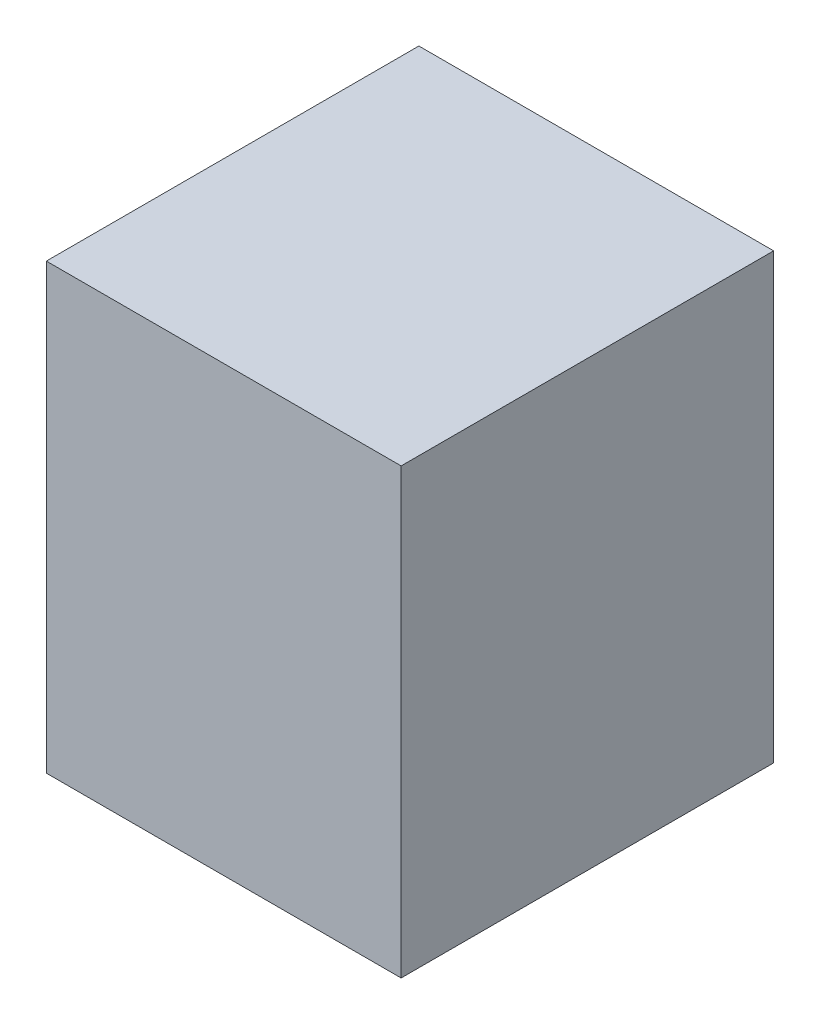
ISO-10303-21;
HEADER;
FILE_DESCRIPTION(('STEP AP214'),'2;1');
FILE_NAME('part.step','',(''),(''),'','','');
FILE_SCHEMA(('AUTOMOTIVE_DESIGN { 1 0 10303 214 1 1 1 1 }'));
ENDSEC;
DATA;
#1=APPLICATION_CONTEXT('core data for automotive mechanical design processes');
#2=APPLICATION_PROTOCOL_DEFINITION('international standard','automotive_design',2000,#1);
#3=PRODUCT_CONTEXT('',#1,'mechanical');
#4=PRODUCT('Part','Part','',(#3));
#5=PRODUCT_RELATED_PRODUCT_CATEGORY('part','',(#4));
#6=PRODUCT_DEFINITION_FORMATION('','',#4);
#7=PRODUCT_DEFINITION_CONTEXT('part definition',#1,'design');
#8=PRODUCT_DEFINITION('design','',#6,#7);
#9=PRODUCT_DEFINITION_SHAPE('','',#8);
#10=(LENGTH_UNIT() NAMED_UNIT(*) SI_UNIT(.MILLI.,.METRE.));
#11=(NAMED_UNIT(*) PLANE_ANGLE_UNIT() SI_UNIT($,.RADIAN.));
#12=(NAMED_UNIT(*) SI_UNIT($,.STERADIAN.) SOLID_ANGLE_UNIT());
#13=UNCERTAINTY_MEASURE_WITH_UNIT(LENGTH_MEASURE(1.E-05),#10,'distance_accuracy_value','');
#14=(GEOMETRIC_REPRESENTATION_CONTEXT(3) GLOBAL_UNCERTAINTY_ASSIGNED_CONTEXT((#13)) GLOBAL_UNIT_ASSIGNED_CONTEXT((#10,
#11,#12)) REPRESENTATION_CONTEXT('',''));
#15=CARTESIAN_POINT('',(0.,0.,0.));
#16=DIRECTION('',(0.,0.,1.));
#17=DIRECTION('',(1.,0.,0.));
#18=AXIS2_PLACEMENT_3D('',#15,#16,#17);
#19=CARTESIAN_POINT('',(1.00000054,1.25000004,0.));
#20=DIRECTION('',(1.,0.,0.));
#21=DIRECTION('',(0.,0.,-1.));
#22=AXIS2_PLACEMENT_3D('',#19,#20,#21);
#23=PLANE('',#22);
#24=DIRECTION('',(0.,0.,-1.));
#25=VECTOR('',#24,1.);
#26=CARTESIAN_POINT('',(1.00000054,-1.25000004,0.));
#27=LINE('',#26,#25);
#28=CARTESIAN_POINT('',(1.00000054,-1.25000004,0.));
#29=VERTEX_POINT('',#28);
#30=CARTESIAN_POINT('',(1.00000054,-1.25000004,2.10000088));
#31=VERTEX_POINT('',#30);
#32=EDGE_CURVE('E20',#29,#31,#27,.F.);
#33=ORIENTED_EDGE('',*,*,#32,.F.);
#34=DIRECTION('',(0.,1.,0.));
#35=VECTOR('',#34,1.);
#36=CARTESIAN_POINT('',(1.00000054,-1.25000004,0.));
#37=LINE('',#36,#35);
#38=CARTESIAN_POINT('',(1.00000054,1.25000004,0.));
#39=VERTEX_POINT('',#38);
#40=EDGE_CURVE('E79',#29,#39,#37,.T.);
#41=ORIENTED_EDGE('',*,*,#40,.T.);
#42=DIRECTION('',(0.,0.,1.));
#43=VECTOR('',#42,1.);
#44=CARTESIAN_POINT('',(1.00000054,1.25000004,0.));
#45=LINE('',#44,#43);
#46=CARTESIAN_POINT('',(1.00000054,1.25000004,2.10000088));
#47=VERTEX_POINT('',#46);
#48=EDGE_CURVE('E61',#47,#39,#45,.F.);
#49=ORIENTED_EDGE('',*,*,#48,.F.);
#50=DIRECTION('',(0.,1.,0.));
#51=VECTOR('',#50,1.);
#52=CARTESIAN_POINT('',(1.00000054,-1.25000004,2.10000088));
#53=LINE('',#52,#51);
#54=EDGE_CURVE('E56',#31,#47,#53,.T.);
#55=ORIENTED_EDGE('',*,*,#54,.F.);
#56=EDGE_LOOP('',(#33,#41,#49,#55));
#57=FACE_BOUND('',#56,.T.);
#58=ADVANCED_FACE('F17',(#57),#23,.T.);
#59=CARTESIAN_POINT('',(1.00000054,-1.25000004,0.));
#60=DIRECTION('',(0.,-1.,0.));
#61=DIRECTION('',(0.,0.,-1.));
#62=AXIS2_PLACEMENT_3D('',#59,#60,#61);
#63=PLANE('',#62);
#64=DIRECTION('',(0.,0.,1.));
#65=VECTOR('',#64,1.);
#66=CARTESIAN_POINT('',(-1.00000054,-1.25000004,0.));
#67=LINE('',#66,#65);
#68=CARTESIAN_POINT('',(-1.00000054,-1.25000004,0.));
#69=VERTEX_POINT('',#68);
#70=CARTESIAN_POINT('',(-1.00000054,-1.25000004,2.10000088));
#71=VERTEX_POINT('',#70);
#72=EDGE_CURVE('E83',#69,#71,#67,.T.);
#73=ORIENTED_EDGE('',*,*,#72,.F.);
#74=DIRECTION('',(1.,0.,0.));
#75=VECTOR('',#74,1.);
#76=CARTESIAN_POINT('',(1.00000054,-1.25000004,0.));
#77=LINE('',#76,#75);
#78=EDGE_CURVE('E68',#69,#29,#77,.T.);
#79=ORIENTED_EDGE('',*,*,#78,.T.);
#80=ORIENTED_EDGE('',*,*,#32,.T.);
#81=DIRECTION('',(1.,0.,0.));
#82=VECTOR('',#81,1.);
#83=CARTESIAN_POINT('',(1.00000054,-1.25000004,2.10000088));
#84=LINE('',#83,#82);
#85=EDGE_CURVE('E63',#71,#31,#84,.T.);
#86=ORIENTED_EDGE('',*,*,#85,.F.);
#87=EDGE_LOOP('',(#73,#79,#80,#86));
#88=FACE_BOUND('',#87,.T.);
#89=ADVANCED_FACE('F65',(#88),#63,.T.);
#90=CARTESIAN_POINT('',(1.00000054,-1.25000004,2.10000088));
#91=DIRECTION('',(0.,0.,1.));
#92=DIRECTION('',(1.,0.,0.));
#93=AXIS2_PLACEMENT_3D('',#90,#91,#92);
#94=PLANE('',#93);
#95=DIRECTION('',(0.,1.,0.));
#96=VECTOR('',#95,1.);
#97=CARTESIAN_POINT('',(-1.00000054,-1.25000004,2.10000088));
#98=LINE('',#97,#96);
#99=CARTESIAN_POINT('',(-1.00000054,1.25000004,2.10000088));
#100=VERTEX_POINT('',#99);
#101=EDGE_CURVE('E72',#71,#100,#98,.T.);
#102=ORIENTED_EDGE('',*,*,#101,.F.);
#103=ORIENTED_EDGE('',*,*,#85,.T.);
#104=ORIENTED_EDGE('',*,*,#54,.T.);
#105=DIRECTION('',(1.,0.,0.));
#106=VECTOR('',#105,1.);
#107=CARTESIAN_POINT('',(-1.00000054,1.25000004,2.10000088));
#108=LINE('',#107,#106);
#109=EDGE_CURVE('E74',#100,#47,#108,.T.);
#110=ORIENTED_EDGE('',*,*,#109,.F.);
#111=EDGE_LOOP('',(#102,#103,#104,#110));
#112=FACE_BOUND('',#111,.T.);
#113=ADVANCED_FACE('F70',(#112),#94,.T.);
#114=CARTESIAN_POINT('',(-1.00000054,1.25000004,0.));
#115=DIRECTION('',(0.,1.,0.));
#116=DIRECTION('',(0.,0.,1.));
#117=AXIS2_PLACEMENT_3D('',#114,#115,#116);
#118=PLANE('',#117);
#119=ORIENTED_EDGE('',*,*,#48,.T.);
#120=DIRECTION('',(1.,0.,0.));
#121=VECTOR('',#120,1.);
#122=CARTESIAN_POINT('',(1.00000054,1.25000004,0.));
#123=LINE('',#122,#121);
#124=CARTESIAN_POINT('',(-1.00000054,1.25000004,0.));
#125=VERTEX_POINT('',#124);
#126=EDGE_CURVE('E35',#39,#125,#123,.F.);
#127=ORIENTED_EDGE('',*,*,#126,.T.);
#128=DIRECTION('',(0.,0.,1.));
#129=VECTOR('',#128,1.);
#130=CARTESIAN_POINT('',(-1.00000054,1.25000004,0.));
#131=LINE('',#130,#129);
#132=EDGE_CURVE('E26',#100,#125,#131,.F.);
#133=ORIENTED_EDGE('',*,*,#132,.F.);
#134=ORIENTED_EDGE('',*,*,#109,.T.);
#135=EDGE_LOOP('',(#119,#127,#133,#134));
#136=FACE_BOUND('',#135,.T.);
#137=ADVANCED_FACE('F89',(#136),#118,.T.);
#138=CARTESIAN_POINT('',(1.00000054,-1.25000004,0.));
#139=DIRECTION('',(0.,0.,1.));
#140=DIRECTION('',(1.,0.,0.));
#141=AXIS2_PLACEMENT_3D('',#138,#139,#140);
#142=PLANE('',#141);
#143=DIRECTION('',(0.,1.,0.));
#144=VECTOR('',#143,1.);
#145=CARTESIAN_POINT('',(-1.00000054,-1.25000004,0.));
#146=LINE('',#145,#144);
#147=EDGE_CURVE('E11',#125,#69,#146,.F.);
#148=ORIENTED_EDGE('',*,*,#147,.F.);
#149=ORIENTED_EDGE('',*,*,#126,.F.);
#150=ORIENTED_EDGE('',*,*,#40,.F.);
#151=ORIENTED_EDGE('',*,*,#78,.F.);
#152=EDGE_LOOP('',(#148,#149,#150,#151));
#153=FACE_BOUND('',#152,.T.);
#154=ADVANCED_FACE('F91',(#153),#142,.F.);
#155=CARTESIAN_POINT('',(-1.00000054,-1.25000004,0.));
#156=DIRECTION('',(-1.,0.,0.));
#157=DIRECTION('',(0.,0.,1.));
#158=AXIS2_PLACEMENT_3D('',#155,#156,#157);
#159=PLANE('',#158);
#160=ORIENTED_EDGE('',*,*,#132,.T.);
#161=ORIENTED_EDGE('',*,*,#147,.T.);
#162=ORIENTED_EDGE('',*,*,#72,.T.);
#163=ORIENTED_EDGE('',*,*,#101,.T.);
#164=EDGE_LOOP('',(#160,#161,#162,#163));
#165=FACE_BOUND('',#164,.T.);
#166=ADVANCED_FACE('F88',(#165),#159,.T.);
#167=CLOSED_SHELL('',(#58,#89,#113,#137,#154,#166));
#168=MANIFOLD_SOLID_BREP('B1',#167);
#169=ADVANCED_BREP_SHAPE_REPRESENTATION('',(#18,#168),#14);
#170=SHAPE_DEFINITION_REPRESENTATION(#9,#169);
ENDSEC;
END-ISO-10303-21;
